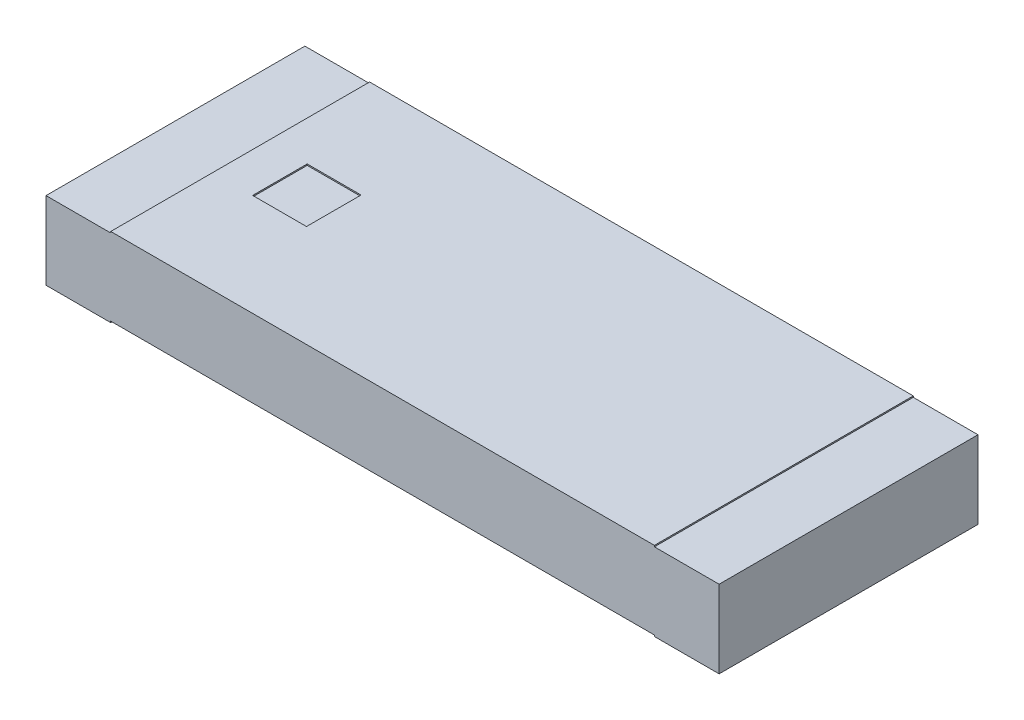
ISO-10303-21;
HEADER;
FILE_DESCRIPTION(('STEP AP214'),'2;1');
FILE_NAME('part.step','',(''),(''),'','','');
FILE_SCHEMA(('AUTOMOTIVE_DESIGN { 1 0 10303 214 1 1 1 1 }'));
ENDSEC;
DATA;
#1=APPLICATION_CONTEXT('core data for automotive mechanical design processes');
#2=APPLICATION_PROTOCOL_DEFINITION('international standard','automotive_design',2000,#1);
#3=PRODUCT_CONTEXT('',#1,'mechanical');
#4=PRODUCT('Part','Part','',(#3));
#5=PRODUCT_RELATED_PRODUCT_CATEGORY('part','',(#4));
#6=PRODUCT_DEFINITION_FORMATION('','',#4);
#7=PRODUCT_DEFINITION_CONTEXT('part definition',#1,'design');
#8=PRODUCT_DEFINITION('design','',#6,#7);
#9=PRODUCT_DEFINITION_SHAPE('','',#8);
#10=(LENGTH_UNIT() NAMED_UNIT(*) SI_UNIT(.MILLI.,.METRE.));
#11=(NAMED_UNIT(*) PLANE_ANGLE_UNIT() SI_UNIT($,.RADIAN.));
#12=(NAMED_UNIT(*) SI_UNIT($,.STERADIAN.) SOLID_ANGLE_UNIT());
#13=UNCERTAINTY_MEASURE_WITH_UNIT(LENGTH_MEASURE(1.E-05),#10,'distance_accuracy_value','');
#14=(GEOMETRIC_REPRESENTATION_CONTEXT(3) GLOBAL_UNCERTAINTY_ASSIGNED_CONTEXT((#13)) GLOBAL_UNIT_ASSIGNED_CONTEXT((#10,
#11,#12)) REPRESENTATION_CONTEXT('',''));
#15=CARTESIAN_POINT('',(0.,0.,0.));
#16=DIRECTION('',(0.,0.,1.));
#17=DIRECTION('',(1.,0.,0.));
#18=AXIS2_PLACEMENT_3D('',#15,#16,#17);
#19=CARTESIAN_POINT('',(0.,0.,0.));
#20=DIRECTION('',(0.,1.,0.));
#21=DIRECTION('',(0.,0.,1.));
#22=AXIS2_PLACEMENT_3D('',#19,#20,#21);
#23=PLANE('',#22);
#24=DIRECTION('',(1.,0.,0.));
#25=VECTOR('',#24,1.);
#26=CARTESIAN_POINT('',(-2.6,0.,1.));
#27=LINE('',#26,#25);
#28=CARTESIAN_POINT('',(2.1,0.,1.));
#29=VERTEX_POINT('',#28);
#30=CARTESIAN_POINT('',(2.6,0.,1.));
#31=VERTEX_POINT('',#30);
#32=EDGE_CURVE('E307',#29,#31,#27,.T.);
#33=ORIENTED_EDGE('',*,*,#32,.F.);
#34=DIRECTION('',(0.,0.,1.));
#35=VECTOR('',#34,1.);
#36=CARTESIAN_POINT('',(2.1,0.,1.));
#37=LINE('',#36,#35);
#38=CARTESIAN_POINT('',(2.1,0.,-1.));
#39=VERTEX_POINT('',#38);
#40=EDGE_CURVE('E160',#39,#29,#37,.T.);
#41=ORIENTED_EDGE('',*,*,#40,.F.);
#42=DIRECTION('',(-1.,0.,0.));
#43=VECTOR('',#42,1.);
#44=CARTESIAN_POINT('',(-2.6,0.,-1.));
#45=LINE('',#44,#43);
#46=CARTESIAN_POINT('',(2.6,0.,-1.));
#47=VERTEX_POINT('',#46);
#48=EDGE_CURVE('E300',#47,#39,#45,.T.);
#49=ORIENTED_EDGE('',*,*,#48,.F.);
#50=DIRECTION('',(0.,0.,-1.));
#51=VECTOR('',#50,1.);
#52=CARTESIAN_POINT('',(2.6,0.,-1.));
#53=LINE('',#52,#51);
#54=EDGE_CURVE('E276',#31,#47,#53,.T.);
#55=ORIENTED_EDGE('',*,*,#54,.F.);
#56=EDGE_LOOP('',(#33,#41,#49,#55));
#57=FACE_BOUND('',#56,.T.);
#58=ADVANCED_FACE('F41',(#57),#23,.F.);
#59=CARTESIAN_POINT('',(0.,0.6,0.));
#60=DIRECTION('',(0.,1.,0.));
#61=DIRECTION('',(0.,0.,1.));
#62=AXIS2_PLACEMENT_3D('',#59,#60,#61);
#63=PLANE('',#62);
#64=DIRECTION('',(-1.,0.,0.));
#65=VECTOR('',#64,1.);
#66=CARTESIAN_POINT('',(-2.6,0.6,-1.));
#67=LINE('',#66,#65);
#68=CARTESIAN_POINT('',(2.6,0.6,-1.));
#69=VERTEX_POINT('',#68);
#70=CARTESIAN_POINT('',(2.1,0.6,-1.));
#71=VERTEX_POINT('',#70);
#72=EDGE_CURVE('E283',#69,#71,#67,.T.);
#73=ORIENTED_EDGE('',*,*,#72,.T.);
#74=DIRECTION('',(0.,0.,1.));
#75=VECTOR('',#74,1.);
#76=CARTESIAN_POINT('',(2.1,0.6,-1.));
#77=LINE('',#76,#75);
#78=CARTESIAN_POINT('',(2.1,0.6,1.));
#79=VERTEX_POINT('',#78);
#80=EDGE_CURVE('E234',#71,#79,#77,.T.);
#81=ORIENTED_EDGE('',*,*,#80,.T.);
#82=DIRECTION('',(1.,0.,0.));
#83=VECTOR('',#82,1.);
#84=CARTESIAN_POINT('',(-2.6,0.6,1.));
#85=LINE('',#84,#83);
#86=CARTESIAN_POINT('',(2.6,0.6,1.));
#87=VERTEX_POINT('',#86);
#88=EDGE_CURVE('E290',#79,#87,#85,.T.);
#89=ORIENTED_EDGE('',*,*,#88,.T.);
#90=DIRECTION('',(0.,0.,-1.));
#91=VECTOR('',#90,1.);
#92=CARTESIAN_POINT('',(2.6,0.6,-1.));
#93=LINE('',#92,#91);
#94=EDGE_CURVE('E277',#87,#69,#93,.T.);
#95=ORIENTED_EDGE('',*,*,#94,.T.);
#96=EDGE_LOOP('',(#73,#81,#89,#95));
#97=FACE_BOUND('',#96,.T.);
#98=ADVANCED_FACE('F351',(#97),#63,.T.);
#99=CARTESIAN_POINT('',(2.6,0.6,-1.));
#100=DIRECTION('',(-1.,0.,0.));
#101=DIRECTION('',(0.,0.,1.));
#102=AXIS2_PLACEMENT_3D('',#99,#100,#101);
#103=PLANE('',#102);
#104=ORIENTED_EDGE('',*,*,#54,.T.);
#105=DIRECTION('',(0.,-1.,0.));
#106=VECTOR('',#105,1.);
#107=CARTESIAN_POINT('',(2.6,0.6,-1.));
#108=LINE('',#107,#106);
#109=EDGE_CURVE('E11',#69,#47,#108,.T.);
#110=ORIENTED_EDGE('',*,*,#109,.F.);
#111=ORIENTED_EDGE('',*,*,#94,.F.);
#112=DIRECTION('',(0.,-1.,0.));
#113=VECTOR('',#112,1.);
#114=CARTESIAN_POINT('',(2.6,0.6,1.));
#115=LINE('',#114,#113);
#116=EDGE_CURVE('E295',#87,#31,#115,.T.);
#117=ORIENTED_EDGE('',*,*,#116,.T.);
#118=EDGE_LOOP('',(#104,#110,#111,#117));
#119=FACE_BOUND('',#118,.T.);
#120=ADVANCED_FACE('F43',(#119),#103,.F.);
#121=CARTESIAN_POINT('',(-2.6,0.6,-1.));
#122=DIRECTION('',(0.,0.,1.));
#123=DIRECTION('',(1.,0.,0.));
#124=AXIS2_PLACEMENT_3D('',#121,#122,#123);
#125=PLANE('',#124);
#126=ORIENTED_EDGE('',*,*,#48,.T.);
#127=DIRECTION('',(0.,-1.,0.));
#128=VECTOR('',#127,1.);
#129=CARTESIAN_POINT('',(2.1,0.01,-1.));
#130=LINE('',#129,#128);
#131=CARTESIAN_POINT('',(2.1,0.01,-1.));
#132=VERTEX_POINT('',#131);
#133=EDGE_CURVE('E191',#132,#39,#130,.T.);
#134=ORIENTED_EDGE('',*,*,#133,.F.);
#135=DIRECTION('',(1.,0.,0.));
#136=VECTOR('',#135,1.);
#137=CARTESIAN_POINT('',(-2.1,0.01,-1.));
#138=LINE('',#137,#136);
#139=CARTESIAN_POINT('',(-2.1,0.01,-1.));
#140=VERTEX_POINT('',#139);
#141=EDGE_CURVE('E165',#140,#132,#138,.T.);
#142=ORIENTED_EDGE('',*,*,#141,.F.);
#143=DIRECTION('',(0.,-1.,0.));
#144=VECTOR('',#143,1.);
#145=CARTESIAN_POINT('',(-2.1,0.01,-1.));
#146=LINE('',#145,#144);
#147=CARTESIAN_POINT('',(-2.1,0.,-1.));
#148=VERTEX_POINT('',#147);
#149=EDGE_CURVE('E194',#140,#148,#146,.T.);
#150=ORIENTED_EDGE('',*,*,#149,.T.);
#151=CARTESIAN_POINT('',(-2.6,0.,-1.));
#152=VERTEX_POINT('',#151);
#153=EDGE_CURVE('E299',#148,#152,#45,.T.);
#154=ORIENTED_EDGE('',*,*,#153,.T.);
#155=DIRECTION('',(0.,-1.,0.));
#156=VECTOR('',#155,1.);
#157=CARTESIAN_POINT('',(-2.6,0.6,-1.));
#158=LINE('',#157,#156);
#159=CARTESIAN_POINT('',(-2.6,0.6,-1.));
#160=VERTEX_POINT('',#159);
#161=EDGE_CURVE('E50',#160,#152,#158,.T.);
#162=ORIENTED_EDGE('',*,*,#161,.F.);
#163=CARTESIAN_POINT('',(-2.1,0.6,-1.));
#164=VERTEX_POINT('',#163);
#165=EDGE_CURVE('E281',#164,#160,#67,.T.);
#166=ORIENTED_EDGE('',*,*,#165,.F.);
#167=DIRECTION('',(0.,-1.,0.));
#168=VECTOR('',#167,1.);
#169=CARTESIAN_POINT('',(-2.1,0.61,-1.));
#170=LINE('',#169,#168);
#171=CARTESIAN_POINT('',(-2.1,0.61,-1.));
#172=VERTEX_POINT('',#171);
#173=EDGE_CURVE('E267',#172,#164,#170,.T.);
#174=ORIENTED_EDGE('',*,*,#173,.F.);
#175=DIRECTION('',(1.,0.,0.));
#176=VECTOR('',#175,1.);
#177=CARTESIAN_POINT('',(-2.1,0.61,-1.));
#178=LINE('',#177,#176);
#179=CARTESIAN_POINT('',(2.1,0.61,-1.));
#180=VERTEX_POINT('',#179);
#181=EDGE_CURVE('E251',#172,#180,#178,.T.);
#182=ORIENTED_EDGE('',*,*,#181,.T.);
#183=DIRECTION('',(0.,-1.,0.));
#184=VECTOR('',#183,1.);
#185=CARTESIAN_POINT('',(2.1,0.61,-1.));
#186=LINE('',#185,#184);
#187=EDGE_CURVE('E270',#180,#71,#186,.T.);
#188=ORIENTED_EDGE('',*,*,#187,.T.);
#189=ORIENTED_EDGE('',*,*,#72,.F.);
#190=ORIENTED_EDGE('',*,*,#109,.T.);
#191=EDGE_LOOP('',(#126,#134,#142,#150,#154,#162,#166,#174,#182,#188,#189,#190));
#192=FACE_BOUND('',#191,.T.);
#193=ADVANCED_FACE('F339',(#192),#125,.F.);
#194=CARTESIAN_POINT('',(-2.6,0.6,-1.));
#195=DIRECTION('',(1.,0.,0.));
#196=DIRECTION('',(0.,0.,-1.));
#197=AXIS2_PLACEMENT_3D('',#194,#195,#196);
#198=PLANE('',#197);
#199=DIRECTION('',(0.,0.,1.));
#200=VECTOR('',#199,1.);
#201=CARTESIAN_POINT('',(-2.6,0.,-1.));
#202=LINE('',#201,#200);
#203=CARTESIAN_POINT('',(-2.6,0.,1.));
#204=VERTEX_POINT('',#203);
#205=EDGE_CURVE('E304',#152,#204,#202,.T.);
#206=ORIENTED_EDGE('',*,*,#205,.T.);
#207=DIRECTION('',(0.,-1.,0.));
#208=VECTOR('',#207,1.);
#209=CARTESIAN_POINT('',(-2.6,0.6,1.));
#210=LINE('',#209,#208);
#211=CARTESIAN_POINT('',(-2.6,0.6,1.));
#212=VERTEX_POINT('',#211);
#213=EDGE_CURVE('E313',#212,#204,#210,.T.);
#214=ORIENTED_EDGE('',*,*,#213,.F.);
#215=DIRECTION('',(0.,0.,1.));
#216=VECTOR('',#215,1.);
#217=CARTESIAN_POINT('',(-2.6,0.6,-1.));
#218=LINE('',#217,#216);
#219=EDGE_CURVE('E287',#160,#212,#218,.T.);
#220=ORIENTED_EDGE('',*,*,#219,.F.);
#221=ORIENTED_EDGE('',*,*,#161,.T.);
#222=EDGE_LOOP('',(#206,#214,#220,#221));
#223=FACE_BOUND('',#222,.T.);
#224=ADVANCED_FACE('F322',(#223),#198,.F.);
#225=CARTESIAN_POINT('',(-2.6,0.6,1.));
#226=DIRECTION('',(0.,0.,-1.));
#227=DIRECTION('',(-1.,0.,0.));
#228=AXIS2_PLACEMENT_3D('',#225,#226,#227);
#229=PLANE('',#228);
#230=DIRECTION('',(-1.,0.,0.));
#231=VECTOR('',#230,1.);
#232=CARTESIAN_POINT('',(-2.1,0.01,1.));
#233=LINE('',#232,#231);
#234=CARTESIAN_POINT('',(2.1,0.01,1.));
#235=VERTEX_POINT('',#234);
#236=CARTESIAN_POINT('',(-2.1,0.01,1.));
#237=VERTEX_POINT('',#236);
#238=EDGE_CURVE('E171',#235,#237,#233,.T.);
#239=ORIENTED_EDGE('',*,*,#238,.F.);
#240=DIRECTION('',(0.,-1.,0.));
#241=VECTOR('',#240,1.);
#242=CARTESIAN_POINT('',(2.1,0.01,1.));
#243=LINE('',#242,#241);
#244=EDGE_CURVE('E154',#235,#29,#243,.T.);
#245=ORIENTED_EDGE('',*,*,#244,.T.);
#246=ORIENTED_EDGE('',*,*,#32,.T.);
#247=ORIENTED_EDGE('',*,*,#116,.F.);
#248=ORIENTED_EDGE('',*,*,#88,.F.);
#249=DIRECTION('',(0.,-1.,0.));
#250=VECTOR('',#249,1.);
#251=CARTESIAN_POINT('',(2.1,0.61,1.));
#252=LINE('',#251,#250);
#253=CARTESIAN_POINT('',(2.1,0.61,1.));
#254=VERTEX_POINT('',#253);
#255=EDGE_CURVE('E273',#254,#79,#252,.T.);
#256=ORIENTED_EDGE('',*,*,#255,.F.);
#257=DIRECTION('',(1.,0.,0.));
#258=VECTOR('',#257,1.);
#259=CARTESIAN_POINT('',(-2.1,0.61,1.));
#260=LINE('',#259,#258);
#261=CARTESIAN_POINT('',(-2.1,0.61,1.));
#262=VERTEX_POINT('',#261);
#263=EDGE_CURVE('E243',#262,#254,#260,.T.);
#264=ORIENTED_EDGE('',*,*,#263,.F.);
#265=DIRECTION('',(0.,-1.,0.));
#266=VECTOR('',#265,1.);
#267=CARTESIAN_POINT('',(-2.1,0.61,1.));
#268=LINE('',#267,#266);
#269=CARTESIAN_POINT('',(-2.1,0.6,1.));
#270=VERTEX_POINT('',#269);
#271=EDGE_CURVE('E258',#262,#270,#268,.T.);
#272=ORIENTED_EDGE('',*,*,#271,.T.);
#273=EDGE_CURVE('E291',#212,#270,#85,.T.);
#274=ORIENTED_EDGE('',*,*,#273,.F.);
#275=ORIENTED_EDGE('',*,*,#213,.T.);
#276=CARTESIAN_POINT('',(-2.1,0.,1.));
#277=VERTEX_POINT('',#276);
#278=EDGE_CURVE('E282',#204,#277,#27,.T.);
#279=ORIENTED_EDGE('',*,*,#278,.T.);
#280=DIRECTION('',(0.,-1.,0.));
#281=VECTOR('',#280,1.);
#282=CARTESIAN_POINT('',(-2.1,0.01,1.));
#283=LINE('',#282,#281);
#284=EDGE_CURVE('E57',#237,#277,#283,.T.);
#285=ORIENTED_EDGE('',*,*,#284,.F.);
#286=EDGE_LOOP('',(#239,#245,#246,#247,#248,#256,#264,#272,#274,#275,#279,#285));
#287=FACE_BOUND('',#286,.T.);
#288=ADVANCED_FACE('F177',(#287),#229,.F.);
#289=DIRECTION('',(0.,0.,1.));
#290=VECTOR('',#289,1.);
#291=CARTESIAN_POINT('',(-2.1,0.6,-1.));
#292=LINE('',#291,#290);
#293=EDGE_CURVE('E247',#164,#270,#292,.T.);
#294=ORIENTED_EDGE('',*,*,#293,.F.);
#295=ORIENTED_EDGE('',*,*,#165,.T.);
#296=ORIENTED_EDGE('',*,*,#219,.T.);
#297=ORIENTED_EDGE('',*,*,#273,.T.);
#298=EDGE_LOOP('',(#294,#295,#296,#297));
#299=FACE_BOUND('',#298,.T.);
#300=ADVANCED_FACE('F335',(#299),#63,.T.);
#301=ORIENTED_EDGE('',*,*,#153,.F.);
#302=DIRECTION('',(0.,0.,-1.));
#303=VECTOR('',#302,1.);
#304=CARTESIAN_POINT('',(-2.1,0.,1.));
#305=LINE('',#304,#303);
#306=EDGE_CURVE('E175',#277,#148,#305,.T.);
#307=ORIENTED_EDGE('',*,*,#306,.F.);
#308=ORIENTED_EDGE('',*,*,#278,.F.);
#309=ORIENTED_EDGE('',*,*,#205,.F.);
#310=EDGE_LOOP('',(#301,#307,#308,#309));
#311=FACE_BOUND('',#310,.T.);
#312=ADVANCED_FACE('F329',(#311),#23,.F.);
#313=CARTESIAN_POINT('',(2.1,0.61,-1.));
#314=DIRECTION('',(1.,0.,0.));
#315=DIRECTION('',(0.,0.,-1.));
#316=AXIS2_PLACEMENT_3D('',#313,#314,#315);
#317=PLANE('',#316);
#318=ORIENTED_EDGE('',*,*,#80,.F.);
#319=ORIENTED_EDGE('',*,*,#187,.F.);
#320=DIRECTION('',(0.,0.,1.));
#321=VECTOR('',#320,1.);
#322=CARTESIAN_POINT('',(2.1,0.61,-1.));
#323=LINE('',#322,#321);
#324=EDGE_CURVE('E246',#180,#254,#323,.T.);
#325=ORIENTED_EDGE('',*,*,#324,.T.);
#326=ORIENTED_EDGE('',*,*,#255,.T.);
#327=EDGE_LOOP('',(#318,#319,#325,#326));
#328=FACE_BOUND('',#327,.T.);
#329=ADVANCED_FACE('F361',(#328),#317,.T.);
#330=CARTESIAN_POINT('',(-2.1,0.61,-1.));
#331=DIRECTION('',(1.,0.,0.));
#332=DIRECTION('',(0.,0.,-1.));
#333=AXIS2_PLACEMENT_3D('',#330,#331,#332);
#334=PLANE('',#333);
#335=ORIENTED_EDGE('',*,*,#293,.T.);
#336=ORIENTED_EDGE('',*,*,#271,.F.);
#337=DIRECTION('',(0.,0.,1.));
#338=VECTOR('',#337,1.);
#339=CARTESIAN_POINT('',(-2.1,0.61,-1.));
#340=LINE('',#339,#338);
#341=EDGE_CURVE('E255',#172,#262,#340,.T.);
#342=ORIENTED_EDGE('',*,*,#341,.F.);
#343=ORIENTED_EDGE('',*,*,#173,.T.);
#344=EDGE_LOOP('',(#335,#336,#342,#343));
#345=FACE_BOUND('',#344,.T.);
#346=ADVANCED_FACE('F366',(#345),#334,.F.);
#347=CARTESIAN_POINT('',(0.,0.61,0.));
#348=DIRECTION('',(0.,-1.,0.));
#349=DIRECTION('',(0.,0.,-1.));
#350=AXIS2_PLACEMENT_3D('',#347,#348,#349);
#351=PLANE('',#350);
#352=DIRECTION('',(-1.,0.,0.));
#353=VECTOR('',#352,1.);
#354=CARTESIAN_POINT('',(-1.7929478893621,0.61,-0.210778100088697));
#355=LINE('',#354,#353);
#356=CARTESIAN_POINT('',(-1.37672784361732,0.61,-0.210778100088697));
#357=VERTEX_POINT('',#356);
#358=CARTESIAN_POINT('',(-1.7929478893621,0.61,-0.210778100088697));
#359=VERTEX_POINT('',#358);
#360=EDGE_CURVE('E220',#357,#359,#355,.T.);
#361=ORIENTED_EDGE('',*,*,#360,.F.);
#362=DIRECTION('',(0.,0.,-1.));
#363=VECTOR('',#362,1.);
#364=CARTESIAN_POINT('',(-1.37672784361732,0.61,-0.210778100088697));
#365=LINE('',#364,#363);
#366=CARTESIAN_POINT('',(-1.37672784361732,0.61,0.210778100088697));
#367=VERTEX_POINT('',#366);
#368=EDGE_CURVE('E65',#367,#357,#365,.T.);
#369=ORIENTED_EDGE('',*,*,#368,.F.);
#370=DIRECTION('',(1.,0.,0.));
#371=VECTOR('',#370,1.);
#372=CARTESIAN_POINT('',(-1.7929478893621,0.61,0.210778100088697));
#373=LINE('',#372,#371);
#374=CARTESIAN_POINT('',(-1.7929478893621,0.61,0.210778100088697));
#375=VERTEX_POINT('',#374);
#376=EDGE_CURVE('E205',#375,#367,#373,.T.);
#377=ORIENTED_EDGE('',*,*,#376,.F.);
#378=DIRECTION('',(0.,0.,1.));
#379=VECTOR('',#378,1.);
#380=CARTESIAN_POINT('',(-1.7929478893621,0.61,-0.210778100088697));
#381=LINE('',#380,#379);
#382=EDGE_CURVE('E224',#359,#375,#381,.T.);
#383=ORIENTED_EDGE('',*,*,#382,.F.);
#384=EDGE_LOOP('',(#361,#369,#377,#383));
#385=FACE_BOUND('',#384,.T.);
#386=ORIENTED_EDGE('',*,*,#263,.T.);
#387=ORIENTED_EDGE('',*,*,#324,.F.);
#388=ORIENTED_EDGE('',*,*,#181,.F.);
#389=ORIENTED_EDGE('',*,*,#341,.T.);
#390=EDGE_LOOP('',(#386,#387,#388,#389));
#391=FACE_BOUND('',#390,.T.);
#392=ADVANCED_FACE('F375',(#385,#391),#351,.F.);
#393=CARTESIAN_POINT('',(-1.37672784361732,0.6,-0.210778100088697));
#394=DIRECTION('',(1.,0.,0.));
#395=DIRECTION('',(0.,0.,-1.));
#396=AXIS2_PLACEMENT_3D('',#393,#394,#395);
#397=PLANE('',#396);
#398=ORIENTED_EDGE('',*,*,#368,.T.);
#399=DIRECTION('',(0.,1.,0.));
#400=VECTOR('',#399,1.);
#401=CARTESIAN_POINT('',(-1.37672784361732,0.6,-0.210778100088697));
#402=LINE('',#401,#400);
#403=CARTESIAN_POINT('',(-1.37672784361732,0.6,-0.210778100088697));
#404=VERTEX_POINT('',#403);
#405=EDGE_CURVE('E217',#404,#357,#402,.T.);
#406=ORIENTED_EDGE('',*,*,#405,.F.);
#407=DIRECTION('',(0.,0.,-1.));
#408=VECTOR('',#407,1.);
#409=CARTESIAN_POINT('',(-1.37672784361732,0.6,-0.210778100088697));
#410=LINE('',#409,#408);
#411=CARTESIAN_POINT('',(-1.37672784361732,0.6,0.210778100088697));
#412=VERTEX_POINT('',#411);
#413=EDGE_CURVE('E200',#412,#404,#410,.T.);
#414=ORIENTED_EDGE('',*,*,#413,.F.);
#415=DIRECTION('',(0.,1.,0.));
#416=VECTOR('',#415,1.);
#417=CARTESIAN_POINT('',(-1.37672784361732,0.6,0.210778100088697));
#418=LINE('',#417,#416);
#419=EDGE_CURVE('E231',#412,#367,#418,.T.);
#420=ORIENTED_EDGE('',*,*,#419,.T.);
#421=EDGE_LOOP('',(#398,#406,#414,#420));
#422=FACE_BOUND('',#421,.T.);
#423=ADVANCED_FACE('F379',(#422),#397,.F.);
#424=CARTESIAN_POINT('',(-1.7929478893621,0.6,0.210778100088697));
#425=DIRECTION('',(0.,0.,1.));
#426=DIRECTION('',(1.,0.,0.));
#427=AXIS2_PLACEMENT_3D('',#424,#425,#426);
#428=PLANE('',#427);
#429=ORIENTED_EDGE('',*,*,#376,.T.);
#430=ORIENTED_EDGE('',*,*,#419,.F.);
#431=DIRECTION('',(1.,0.,0.));
#432=VECTOR('',#431,1.);
#433=CARTESIAN_POINT('',(-1.7929478893621,0.6,0.210778100088697));
#434=LINE('',#433,#432);
#435=CARTESIAN_POINT('',(-1.7929478893621,0.6,0.210778100088697));
#436=VERTEX_POINT('',#435);
#437=EDGE_CURVE('E213',#436,#412,#434,.T.);
#438=ORIENTED_EDGE('',*,*,#437,.F.);
#439=DIRECTION('',(0.,1.,0.));
#440=VECTOR('',#439,1.);
#441=CARTESIAN_POINT('',(-1.7929478893621,0.6,0.210778100088697));
#442=LINE('',#441,#440);
#443=EDGE_CURVE('E235',#436,#375,#442,.T.);
#444=ORIENTED_EDGE('',*,*,#443,.T.);
#445=EDGE_LOOP('',(#429,#430,#438,#444));
#446=FACE_BOUND('',#445,.T.);
#447=ADVANCED_FACE('F383',(#446),#428,.F.);
#448=CARTESIAN_POINT('',(-1.7929478893621,0.6,-0.210778100088697));
#449=DIRECTION('',(-1.,0.,0.));
#450=DIRECTION('',(0.,0.,1.));
#451=AXIS2_PLACEMENT_3D('',#448,#449,#450);
#452=PLANE('',#451);
#453=ORIENTED_EDGE('',*,*,#382,.T.);
#454=ORIENTED_EDGE('',*,*,#443,.F.);
#455=DIRECTION('',(0.,0.,1.));
#456=VECTOR('',#455,1.);
#457=CARTESIAN_POINT('',(-1.7929478893621,0.6,-0.210778100088697));
#458=LINE('',#457,#456);
#459=CARTESIAN_POINT('',(-1.7929478893621,0.6,-0.210778100088697));
#460=VERTEX_POINT('',#459);
#461=EDGE_CURVE('E209',#460,#436,#458,.T.);
#462=ORIENTED_EDGE('',*,*,#461,.F.);
#463=DIRECTION('',(0.,1.,0.));
#464=VECTOR('',#463,1.);
#465=CARTESIAN_POINT('',(-1.7929478893621,0.6,-0.210778100088697));
#466=LINE('',#465,#464);
#467=EDGE_CURVE('E238',#460,#359,#466,.T.);
#468=ORIENTED_EDGE('',*,*,#467,.T.);
#469=EDGE_LOOP('',(#453,#454,#462,#468));
#470=FACE_BOUND('',#469,.T.);
#471=ADVANCED_FACE('F387',(#470),#452,.F.);
#472=CARTESIAN_POINT('',(-1.7929478893621,0.6,-0.210778100088697));
#473=DIRECTION('',(0.,0.,-1.));
#474=DIRECTION('',(-1.,0.,0.));
#475=AXIS2_PLACEMENT_3D('',#472,#473,#474);
#476=PLANE('',#475);
#477=ORIENTED_EDGE('',*,*,#360,.T.);
#478=ORIENTED_EDGE('',*,*,#467,.F.);
#479=DIRECTION('',(-1.,0.,0.));
#480=VECTOR('',#479,1.);
#481=CARTESIAN_POINT('',(-1.7929478893621,0.6,-0.210778100088697));
#482=LINE('',#481,#480);
#483=EDGE_CURVE('E204',#404,#460,#482,.T.);
#484=ORIENTED_EDGE('',*,*,#483,.F.);
#485=ORIENTED_EDGE('',*,*,#405,.T.);
#486=EDGE_LOOP('',(#477,#478,#484,#485));
#487=FACE_BOUND('',#486,.T.);
#488=ADVANCED_FACE('F384',(#487),#476,.F.);
#489=CARTESIAN_POINT('',(0.,0.6,0.));
#490=DIRECTION('',(0.,1.,0.));
#491=DIRECTION('',(0.,0.,1.));
#492=AXIS2_PLACEMENT_3D('',#489,#490,#491);
#493=PLANE('',#492);
#494=ORIENTED_EDGE('',*,*,#413,.T.);
#495=ORIENTED_EDGE('',*,*,#483,.T.);
#496=ORIENTED_EDGE('',*,*,#461,.T.);
#497=ORIENTED_EDGE('',*,*,#437,.T.);
#498=EDGE_LOOP('',(#494,#495,#496,#497));
#499=FACE_BOUND('',#498,.T.);
#500=ADVANCED_FACE('F348',(#499),#493,.T.);
#501=CARTESIAN_POINT('',(2.1,0.01,1.));
#502=DIRECTION('',(1.,0.,0.));
#503=DIRECTION('',(0.,0.,-1.));
#504=AXIS2_PLACEMENT_3D('',#501,#502,#503);
#505=PLANE('',#504);
#506=ORIENTED_EDGE('',*,*,#40,.T.);
#507=ORIENTED_EDGE('',*,*,#244,.F.);
#508=DIRECTION('',(0.,0.,1.));
#509=VECTOR('',#508,1.);
#510=CARTESIAN_POINT('',(2.1,0.01,1.));
#511=LINE('',#510,#509);
#512=EDGE_CURVE('E157',#132,#235,#511,.T.);
#513=ORIENTED_EDGE('',*,*,#512,.F.);
#514=ORIENTED_EDGE('',*,*,#133,.T.);
#515=EDGE_LOOP('',(#506,#507,#513,#514));
#516=FACE_BOUND('',#515,.T.);
#517=ADVANCED_FACE('F156',(#516),#505,.F.);
#518=CARTESIAN_POINT('',(-2.1,0.01,1.));
#519=DIRECTION('',(-1.,0.,0.));
#520=DIRECTION('',(0.,0.,1.));
#521=AXIS2_PLACEMENT_3D('',#518,#519,#520);
#522=PLANE('',#521);
#523=ORIENTED_EDGE('',*,*,#306,.T.);
#524=ORIENTED_EDGE('',*,*,#149,.F.);
#525=DIRECTION('',(0.,0.,-1.));
#526=VECTOR('',#525,1.);
#527=CARTESIAN_POINT('',(-2.1,0.01,1.));
#528=LINE('',#527,#526);
#529=EDGE_CURVE('E180',#237,#140,#528,.T.);
#530=ORIENTED_EDGE('',*,*,#529,.F.);
#531=ORIENTED_EDGE('',*,*,#284,.T.);
#532=EDGE_LOOP('',(#523,#524,#530,#531));
#533=FACE_BOUND('',#532,.T.);
#534=ADVANCED_FACE('F340',(#533),#522,.F.);
#535=CARTESIAN_POINT('',(0.,0.01,0.));
#536=DIRECTION('',(0.,-1.,0.));
#537=DIRECTION('',(0.,0.,-1.));
#538=AXIS2_PLACEMENT_3D('',#535,#536,#537);
#539=PLANE('',#538);
#540=ORIENTED_EDGE('',*,*,#512,.T.);
#541=ORIENTED_EDGE('',*,*,#238,.T.);
#542=ORIENTED_EDGE('',*,*,#529,.T.);
#543=ORIENTED_EDGE('',*,*,#141,.T.);
#544=EDGE_LOOP('',(#540,#541,#542,#543));
#545=FACE_BOUND('',#544,.T.);
#546=ADVANCED_FACE('F169',(#545),#539,.T.);
#547=CLOSED_SHELL('',(#58,#98,#120,#193,#224,#288,#300,#312,#329,#346,#392,#423,#447,#471,#488,
#500,#517,#534,#546));
#548=MANIFOLD_SOLID_BREP('B2',#547);
#549=ADVANCED_BREP_SHAPE_REPRESENTATION('',(#18,#548),#14);
#550=SHAPE_DEFINITION_REPRESENTATION(#9,#549);
ENDSEC;
END-ISO-10303-21;
